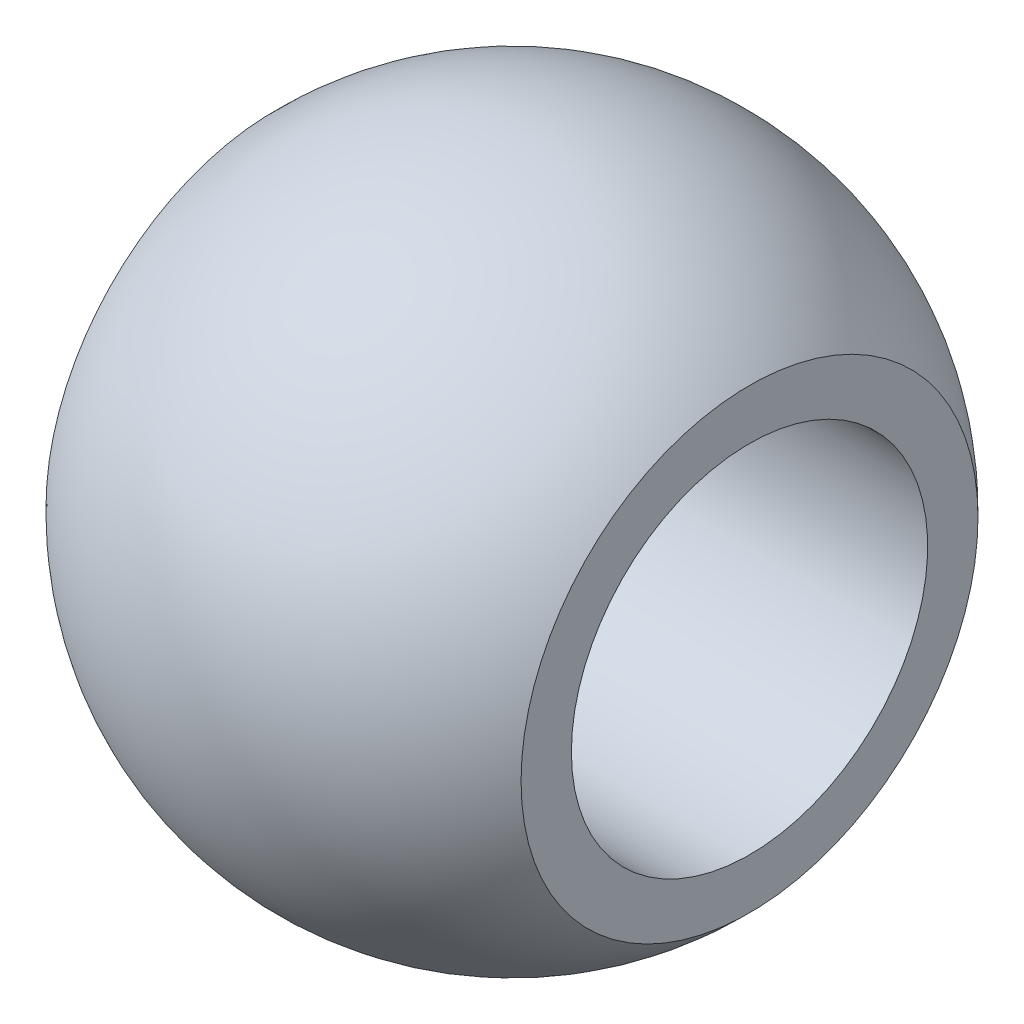
ISO-10303-21;
HEADER;
FILE_DESCRIPTION(('STEP AP214'),'2;1');
FILE_NAME('part.step','',(''),(''),'','','');
FILE_SCHEMA(('AUTOMOTIVE_DESIGN { 1 0 10303 214 1 1 1 1 }'));
ENDSEC;
DATA;
#1=APPLICATION_CONTEXT('core data for automotive mechanical design processes');
#2=APPLICATION_PROTOCOL_DEFINITION('international standard','automotive_design',2000,#1);
#3=PRODUCT_CONTEXT('',#1,'mechanical');
#4=PRODUCT('Part','Part','',(#3));
#5=PRODUCT_RELATED_PRODUCT_CATEGORY('part','',(#4));
#6=PRODUCT_DEFINITION_FORMATION('','',#4);
#7=PRODUCT_DEFINITION_CONTEXT('part definition',#1,'design');
#8=PRODUCT_DEFINITION('design','',#6,#7);
#9=PRODUCT_DEFINITION_SHAPE('','',#8);
#10=(LENGTH_UNIT() NAMED_UNIT(*) SI_UNIT(.MILLI.,.METRE.));
#11=(NAMED_UNIT(*) PLANE_ANGLE_UNIT() SI_UNIT($,.RADIAN.));
#12=(NAMED_UNIT(*) SI_UNIT($,.STERADIAN.) SOLID_ANGLE_UNIT());
#13=UNCERTAINTY_MEASURE_WITH_UNIT(LENGTH_MEASURE(1.E-05),#10,'distance_accuracy_value','');
#14=(GEOMETRIC_REPRESENTATION_CONTEXT(3) GLOBAL_UNCERTAINTY_ASSIGNED_CONTEXT((#13)) GLOBAL_UNIT_ASSIGNED_CONTEXT((#10,
#11,#12)) REPRESENTATION_CONTEXT('',''));
#15=CARTESIAN_POINT('',(0.,0.,0.));
#16=DIRECTION('',(0.,0.,1.));
#17=DIRECTION('',(1.,0.,0.));
#18=AXIS2_PLACEMENT_3D('',#15,#16,#17);
#19=CARTESIAN_POINT('',(0.,0.,0.));
#20=DIRECTION('',(-1.,0.,0.));
#21=DIRECTION('',(0.,1.,0.));
#22=AXIS2_PLACEMENT_3D('',#19,#20,#21);
#23=SPHERICAL_SURFACE('',#22,11.1);
#24=CARTESIAN_POINT('',(-8.00000000000001,0.,0.));
#25=DIRECTION('',(-1.,0.,0.));
#26=DIRECTION('',(0.,0.,1.));
#27=AXIS2_PLACEMENT_3D('',#24,#25,#26);
#28=CIRCLE('',#27,7.69480344128425);
#29=CARTESIAN_POINT('',(-8.00000000000001,0.,7.69480344128425));
#30=VERTEX_POINT('',#29);
#31=EDGE_CURVE('E42',#30,#30,#28,.T.);
#32=ORIENTED_EDGE('',*,*,#31,.F.);
#33=EDGE_LOOP('',(#32));
#34=FACE_BOUND('',#33,.T.);
#35=CARTESIAN_POINT('',(8.00000000000002,0.,0.));
#36=DIRECTION('',(-1.,0.,0.));
#37=DIRECTION('',(0.,0.,1.));
#38=AXIS2_PLACEMENT_3D('',#35,#36,#37);
#39=CIRCLE('',#38,7.69480344128425);
#40=CARTESIAN_POINT('',(8.00000000000002,0.,7.69480344128427));
#41=VERTEX_POINT('',#40);
#42=EDGE_CURVE('E10',#41,#41,#39,.T.);
#43=ORIENTED_EDGE('',*,*,#42,.T.);
#44=EDGE_LOOP('',(#43));
#45=FACE_BOUND('',#44,.T.);
#46=ADVANCED_FACE('F28',(#34,#45),#23,.T.);
#47=CARTESIAN_POINT('',(8.00000000000001,7.69480344128425,0.));
#48=DIRECTION('',(-1.,0.,0.));
#49=DIRECTION('',(0.,0.,1.));
#50=AXIS2_PLACEMENT_3D('',#47,#48,#49);
#51=PLANE('',#50);
#52=ORIENTED_EDGE('',*,*,#42,.F.);
#53=EDGE_LOOP('',(#52));
#54=FACE_BOUND('',#53,.T.);
#55=CARTESIAN_POINT('',(8.00000000000001,0.,0.));
#56=DIRECTION('',(-1.,0.,0.));
#57=DIRECTION('',(0.,0.,1.));
#58=AXIS2_PLACEMENT_3D('',#55,#56,#57);
#59=CIRCLE('',#58,6.);
#60=CARTESIAN_POINT('',(8.00000000000002,0.,6.00000000000001));
#61=VERTEX_POINT('',#60);
#62=EDGE_CURVE('E34',#61,#61,#59,.T.);
#63=ORIENTED_EDGE('',*,*,#62,.T.);
#64=EDGE_LOOP('',(#63));
#65=FACE_BOUND('',#64,.T.);
#66=ADVANCED_FACE('F51',(#54,#65),#51,.F.);
#67=CARTESIAN_POINT('',(0.,0.,0.));
#68=DIRECTION('',(-1.,0.,0.));
#69=DIRECTION('',(0.,0.,1.));
#70=AXIS2_PLACEMENT_3D('',#67,#68,#69);
#71=CYLINDRICAL_SURFACE('',#70,6.);
#72=ORIENTED_EDGE('',*,*,#62,.F.);
#73=EDGE_LOOP('',(#72));
#74=FACE_BOUND('',#73,.T.);
#75=CARTESIAN_POINT('',(-8.00000000000001,0.,0.));
#76=DIRECTION('',(-1.,0.,0.));
#77=DIRECTION('',(0.,0.,1.));
#78=AXIS2_PLACEMENT_3D('',#75,#76,#77);
#79=CIRCLE('',#78,6.);
#80=CARTESIAN_POINT('',(-8.00000000000001,0.,6.));
#81=VERTEX_POINT('',#80);
#82=EDGE_CURVE('E38',#81,#81,#79,.T.);
#83=ORIENTED_EDGE('',*,*,#82,.T.);
#84=EDGE_LOOP('',(#83));
#85=FACE_BOUND('',#84,.T.);
#86=ADVANCED_FACE('F55',(#74,#85),#71,.F.);
#87=CARTESIAN_POINT('',(-8.00000000000002,7.69480344128425,0.));
#88=DIRECTION('',(1.,0.,0.));
#89=DIRECTION('',(0.,0.,-1.));
#90=AXIS2_PLACEMENT_3D('',#87,#88,#89);
#91=PLANE('',#90);
#92=ORIENTED_EDGE('',*,*,#82,.F.);
#93=EDGE_LOOP('',(#92));
#94=FACE_BOUND('',#93,.T.);
#95=ORIENTED_EDGE('',*,*,#31,.T.);
#96=EDGE_LOOP('',(#95));
#97=FACE_BOUND('',#96,.T.);
#98=ADVANCED_FACE('F48',(#94,#97),#91,.F.);
#99=CLOSED_SHELL('',(#46,#66,#86,#98));
#100=MANIFOLD_SOLID_BREP('B2',#99);
#101=ADVANCED_BREP_SHAPE_REPRESENTATION('',(#18,#100),#14);
#102=SHAPE_DEFINITION_REPRESENTATION(#9,#101);
ENDSEC;
END-ISO-10303-21;
